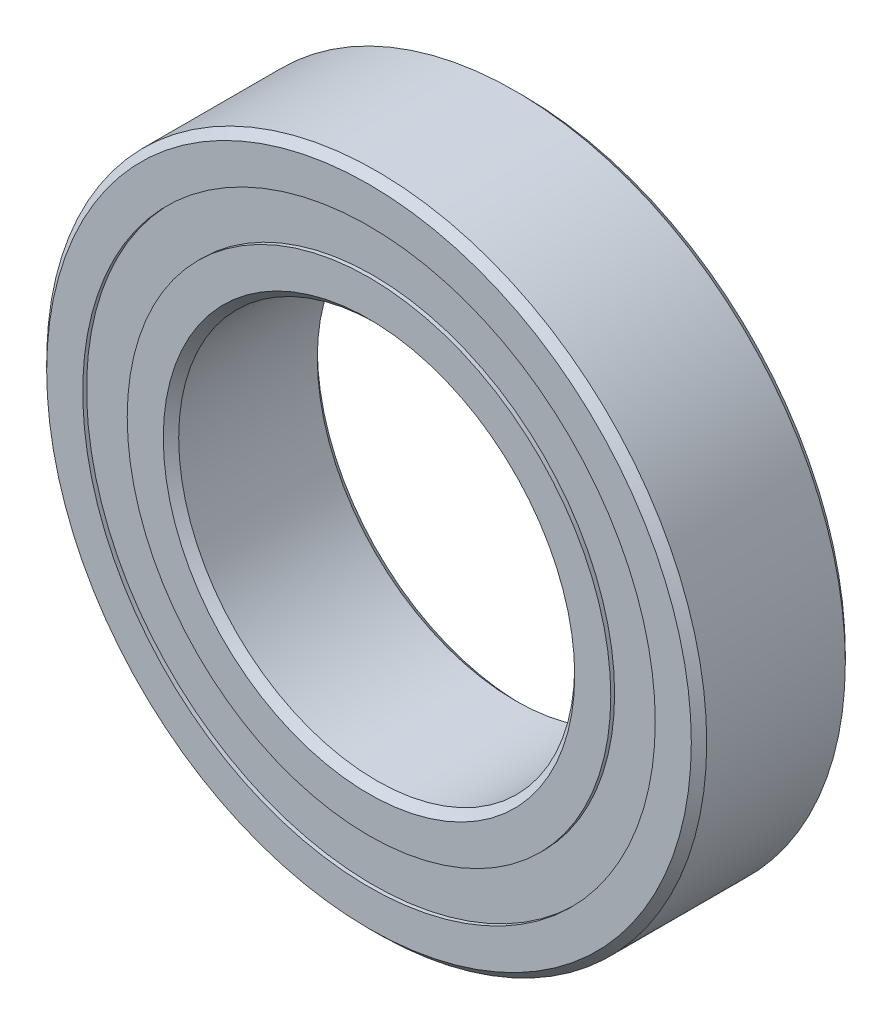
ISO-10303-21;
HEADER;
FILE_DESCRIPTION(('STEP AP214'),'2;1');
FILE_NAME('part.step','',(''),(''),'','','');
FILE_SCHEMA(('AUTOMOTIVE_DESIGN { 1 0 10303 214 1 1 1 1 }'));
ENDSEC;
DATA;
#1=APPLICATION_CONTEXT('core data for automotive mechanical design processes');
#2=APPLICATION_PROTOCOL_DEFINITION('international standard','automotive_design',2000,#1);
#3=PRODUCT_CONTEXT('',#1,'mechanical');
#4=PRODUCT('Part','Part','',(#3));
#5=PRODUCT_RELATED_PRODUCT_CATEGORY('part','',(#4));
#6=PRODUCT_DEFINITION_FORMATION('','',#4);
#7=PRODUCT_DEFINITION_CONTEXT('part definition',#1,'design');
#8=PRODUCT_DEFINITION('design','',#6,#7);
#9=PRODUCT_DEFINITION_SHAPE('','',#8);
#10=(LENGTH_UNIT() NAMED_UNIT(*) SI_UNIT(.MILLI.,.METRE.));
#11=(NAMED_UNIT(*) PLANE_ANGLE_UNIT() SI_UNIT($,.RADIAN.));
#12=(NAMED_UNIT(*) SI_UNIT($,.STERADIAN.) SOLID_ANGLE_UNIT());
#13=UNCERTAINTY_MEASURE_WITH_UNIT(LENGTH_MEASURE(1.E-05),#10,'distance_accuracy_value','');
#14=(GEOMETRIC_REPRESENTATION_CONTEXT(3) GLOBAL_UNCERTAINTY_ASSIGNED_CONTEXT((#13)) GLOBAL_UNIT_ASSIGNED_CONTEXT((#10,
#11,#12)) REPRESENTATION_CONTEXT('',''));
#15=CARTESIAN_POINT('',(0.,0.,0.));
#16=DIRECTION('',(0.,0.,1.));
#17=DIRECTION('',(1.,0.,0.));
#18=AXIS2_PLACEMENT_3D('',#15,#16,#17);
#19=CARTESIAN_POINT('',(0.,13.010989010989,-3.325));
#20=DIRECTION('',(0.,0.,1.));
#21=DIRECTION('',(1.,0.,0.));
#22=AXIS2_PLACEMENT_3D('',#19,#20,#21);
#23=PLANE('',#22);
#24=CARTESIAN_POINT('',(0.,0.,-3.325));
#25=DIRECTION('',(0.,0.,1.));
#26=DIRECTION('',(1.,0.,0.));
#27=AXIS2_PLACEMENT_3D('',#24,#25,#26);
#28=CIRCLE('',#27,13.010989010989);
#29=CARTESIAN_POINT('',(13.010989010989,0.,-3.325));
#30=VERTEX_POINT('',#29);
#31=EDGE_CURVE('E62',#30,#30,#28,.T.);
#32=ORIENTED_EDGE('',*,*,#31,.F.);
#33=EDGE_LOOP('',(#32));
#34=FACE_BOUND('',#33,.T.);
#35=CARTESIAN_POINT('',(0.,0.,-3.325));
#36=DIRECTION('',(0.,0.,1.));
#37=DIRECTION('',(1.,0.,0.));
#38=AXIS2_PLACEMENT_3D('',#35,#36,#37);
#39=CIRCLE('',#38,10.989010989011);
#40=CARTESIAN_POINT('',(10.989010989011,0.,-3.325));
#41=VERTEX_POINT('',#40);
#42=EDGE_CURVE('E11',#41,#41,#39,.T.);
#43=ORIENTED_EDGE('',*,*,#42,.T.);
#44=EDGE_LOOP('',(#43));
#45=FACE_BOUND('',#44,.T.);
#46=ADVANCED_FACE('F48',(#34,#45),#23,.F.);
#47=CARTESIAN_POINT('',(0.,0.,3.5));
#48=DIRECTION('',(0.,0.,1.));
#49=DIRECTION('',(1.,0.,0.));
#50=AXIS2_PLACEMENT_3D('',#47,#48,#49);
#51=CYLINDRICAL_SURFACE('',#50,10.989010989011);
#52=ORIENTED_EDGE('',*,*,#42,.F.);
#53=EDGE_LOOP('',(#52));
#54=FACE_BOUND('',#53,.T.);
#55=CARTESIAN_POINT('',(0.,0.,-1.85522286175012));
#56=DIRECTION('',(0.,0.,1.));
#57=DIRECTION('',(1.,0.,0.));
#58=AXIS2_PLACEMENT_3D('',#55,#56,#57);
#59=CIRCLE('',#58,10.989010989011);
#60=CARTESIAN_POINT('',(10.989010989011,0.,-1.85522286175012));
#61=VERTEX_POINT('',#60);
#62=EDGE_CURVE('E54',#61,#61,#59,.T.);
#63=ORIENTED_EDGE('',*,*,#62,.T.);
#64=EDGE_LOOP('',(#63));
#65=FACE_BOUND('',#64,.T.);
#66=ADVANCED_FACE('F71',(#54,#65),#51,.F.);
#67=CARTESIAN_POINT('',(0.,13.010989010989,-1.85522286175012));
#68=DIRECTION('',(0.,0.,-1.));
#69=DIRECTION('',(-1.,0.,0.));
#70=AXIS2_PLACEMENT_3D('',#67,#68,#69);
#71=PLANE('',#70);
#72=ORIENTED_EDGE('',*,*,#62,.F.);
#73=EDGE_LOOP('',(#72));
#74=FACE_BOUND('',#73,.T.);
#75=CARTESIAN_POINT('',(0.,0.,-1.85522286175012));
#76=DIRECTION('',(0.,0.,1.));
#77=DIRECTION('',(1.,0.,0.));
#78=AXIS2_PLACEMENT_3D('',#75,#76,#77);
#79=CIRCLE('',#78,13.010989010989);
#80=CARTESIAN_POINT('',(13.010989010989,0.,-1.85522286175012));
#81=VERTEX_POINT('',#80);
#82=EDGE_CURVE('E58',#81,#81,#79,.T.);
#83=ORIENTED_EDGE('',*,*,#82,.T.);
#84=EDGE_LOOP('',(#83));
#85=FACE_BOUND('',#84,.T.);
#86=ADVANCED_FACE('F75',(#74,#85),#71,.F.);
#87=CARTESIAN_POINT('',(0.,0.,3.5));
#88=DIRECTION('',(0.,0.,1.));
#89=DIRECTION('',(1.,0.,0.));
#90=AXIS2_PLACEMENT_3D('',#87,#88,#89);
#91=CYLINDRICAL_SURFACE('',#90,13.010989010989);
#92=ORIENTED_EDGE('',*,*,#82,.F.);
#93=EDGE_LOOP('',(#92));
#94=FACE_BOUND('',#93,.T.);
#95=ORIENTED_EDGE('',*,*,#31,.T.);
#96=EDGE_LOOP('',(#95));
#97=FACE_BOUND('',#96,.T.);
#98=ADVANCED_FACE('F68',(#94,#97),#91,.T.);
#99=CLOSED_SHELL('',(#46,#66,#86,#98));
#100=MANIFOLD_SOLID_BREP('B2',#99);
#101=CARTESIAN_POINT('',(0.,13.010989010989,3.325));
#102=DIRECTION('',(0.,0.,-1.));
#103=DIRECTION('',(-1.,0.,0.));
#104=AXIS2_PLACEMENT_3D('',#101,#102,#103);
#105=PLANE('',#104);
#106=CARTESIAN_POINT('',(0.,0.,3.325));
#107=DIRECTION('',(0.,0.,1.));
#108=DIRECTION('',(1.,0.,0.));
#109=AXIS2_PLACEMENT_3D('',#106,#107,#108);
#110=CIRCLE('',#109,10.989010989011);
#111=CARTESIAN_POINT('',(10.989010989011,0.,3.325));
#112=VERTEX_POINT('',#111);
#113=EDGE_CURVE('E47',#112,#112,#110,.T.);
#114=ORIENTED_EDGE('',*,*,#113,.F.);
#115=EDGE_LOOP('',(#114));
#116=FACE_BOUND('',#115,.T.);
#117=CARTESIAN_POINT('',(0.,0.,3.325));
#118=DIRECTION('',(0.,0.,1.));
#119=DIRECTION('',(1.,0.,0.));
#120=AXIS2_PLACEMENT_3D('',#117,#118,#119);
#121=CIRCLE('',#120,13.010989010989);
#122=CARTESIAN_POINT('',(13.010989010989,0.,3.325));
#123=VERTEX_POINT('',#122);
#124=EDGE_CURVE('E130',#123,#123,#121,.T.);
#125=ORIENTED_EDGE('',*,*,#124,.T.);
#126=EDGE_LOOP('',(#125));
#127=FACE_BOUND('',#126,.T.);
#128=ADVANCED_FACE('F116',(#116,#127),#105,.F.);
#129=CARTESIAN_POINT('',(0.,0.,3.5));
#130=DIRECTION('',(0.,0.,1.));
#131=DIRECTION('',(1.,0.,0.));
#132=AXIS2_PLACEMENT_3D('',#129,#130,#131);
#133=CYLINDRICAL_SURFACE('',#132,10.989010989011);
#134=CARTESIAN_POINT('',(0.,0.,1.85522286175011));
#135=DIRECTION('',(0.,0.,1.));
#136=DIRECTION('',(1.,0.,0.));
#137=AXIS2_PLACEMENT_3D('',#134,#135,#136);
#138=CIRCLE('',#137,10.989010989011);
#139=CARTESIAN_POINT('',(10.989010989011,0.,1.85522286175011));
#140=VERTEX_POINT('',#139);
#141=EDGE_CURVE('E122',#140,#140,#138,.T.);
#142=ORIENTED_EDGE('',*,*,#141,.F.);
#143=EDGE_LOOP('',(#142));
#144=FACE_BOUND('',#143,.T.);
#145=ORIENTED_EDGE('',*,*,#113,.T.);
#146=EDGE_LOOP('',(#145));
#147=FACE_BOUND('',#146,.T.);
#148=ADVANCED_FACE('F145',(#144,#147),#133,.F.);
#149=CARTESIAN_POINT('',(0.,13.010989010989,1.85522286175011));
#150=DIRECTION('',(0.,0.,1.));
#151=DIRECTION('',(1.,0.,0.));
#152=AXIS2_PLACEMENT_3D('',#149,#150,#151);
#153=PLANE('',#152);
#154=CARTESIAN_POINT('',(0.,0.,1.85522286175011));
#155=DIRECTION('',(0.,0.,1.));
#156=DIRECTION('',(1.,0.,0.));
#157=AXIS2_PLACEMENT_3D('',#154,#155,#156);
#158=CIRCLE('',#157,13.010989010989);
#159=CARTESIAN_POINT('',(13.010989010989,0.,1.85522286175011));
#160=VERTEX_POINT('',#159);
#161=EDGE_CURVE('E126',#160,#160,#158,.T.);
#162=ORIENTED_EDGE('',*,*,#161,.F.);
#163=EDGE_LOOP('',(#162));
#164=FACE_BOUND('',#163,.T.);
#165=ORIENTED_EDGE('',*,*,#141,.T.);
#166=EDGE_LOOP('',(#165));
#167=FACE_BOUND('',#166,.T.);
#168=ADVANCED_FACE('F140',(#164,#167),#153,.F.);
#169=CARTESIAN_POINT('',(0.,0.,3.5));
#170=DIRECTION('',(0.,0.,1.));
#171=DIRECTION('',(1.,0.,0.));
#172=AXIS2_PLACEMENT_3D('',#169,#170,#171);
#173=CYLINDRICAL_SURFACE('',#172,13.010989010989);
#174=ORIENTED_EDGE('',*,*,#124,.F.);
#175=EDGE_LOOP('',(#174));
#176=FACE_BOUND('',#175,.T.);
#177=ORIENTED_EDGE('',*,*,#161,.T.);
#178=EDGE_LOOP('',(#177));
#179=FACE_BOUND('',#178,.T.);
#180=ADVANCED_FACE('F137',(#176,#179),#173,.T.);
#181=CLOSED_SHELL('',(#128,#148,#168,#180));
#182=MANIFOLD_SOLID_BREP('B6',#181);
#183=CARTESIAN_POINT('',(-5.99999999999987,10.3923048454133,0.));
#184=DIRECTION('',(0.,0.,1.));
#185=DIRECTION('',(-0.499999999999989,0.866025403784445,0.));
#186=AXIS2_PLACEMENT_3D('',#183,#184,#185);
#187=SPHERICAL_SURFACE('',#186,1.85522286175011);
#188=CARTESIAN_POINT('',(-5.99999999999987,10.3923048454133,1.85522286175011));
#189=VERTEX_POINT('',#188);
#190=VERTEX_LOOP('',#189);
#191=FACE_BOUND('',#190,.T.);
#192=ADVANCED_FACE('F184',(#191),#187,.T.);
#193=CLOSED_SHELL('',(#192));
#194=MANIFOLD_SOLID_BREP('B42',#193);
#195=CARTESIAN_POINT('',(-10.3923048454132,6.00000000000012,0.));
#196=DIRECTION('',(0.,0.,1.));
#197=DIRECTION('',(-0.866025403784433,0.50000000000001,0.));
#198=AXIS2_PLACEMENT_3D('',#195,#196,#197);
#199=SPHERICAL_SURFACE('',#198,1.85522286175011);
#200=CARTESIAN_POINT('',(-10.3923048454132,6.00000000000012,1.85522286175011));
#201=VERTEX_POINT('',#200);
#202=VERTEX_LOOP('',#201);
#203=FACE_BOUND('',#202,.T.);
#204=ADVANCED_FACE('F205',(#203),#199,.T.);
#205=CLOSED_SHELL('',(#204));
#206=MANIFOLD_SOLID_BREP('B112',#205);
#207=CARTESIAN_POINT('',(-12.,1.25693328198353E-13,0.));
#208=DIRECTION('',(0.,0.,1.));
#209=DIRECTION('',(-1.,0.,0.));
#210=AXIS2_PLACEMENT_3D('',#207,#208,#209);
#211=SPHERICAL_SURFACE('',#210,1.85522286175011);
#212=CARTESIAN_POINT('',(-12.,1.25693328198353E-13,1.85522286175011));
#213=VERTEX_POINT('',#212);
#214=VERTEX_LOOP('',#213);
#215=FACE_BOUND('',#214,.T.);
#216=ADVANCED_FACE('F226',(#215),#211,.T.);
#217=CLOSED_SHELL('',(#216));
#218=MANIFOLD_SOLID_BREP('B180',#217);
#219=CARTESIAN_POINT('',(-10.3923048454133,-5.9999999999999,0.));
#220=DIRECTION('',(0.,0.,1.));
#221=DIRECTION('',(-0.866025403784443,-0.499999999999992,0.));
#222=AXIS2_PLACEMENT_3D('',#219,#220,#221);
#223=SPHERICAL_SURFACE('',#222,1.85522286175011);
#224=CARTESIAN_POINT('',(-10.3923048454133,-5.9999999999999,1.85522286175011));
#225=VERTEX_POINT('',#224);
#226=VERTEX_LOOP('',#225);
#227=FACE_BOUND('',#226,.T.);
#228=ADVANCED_FACE('F247',(#227),#223,.T.);
#229=CLOSED_SHELL('',(#228));
#230=MANIFOLD_SOLID_BREP('B201',#229);
#231=CARTESIAN_POINT('',(-6.00000000000009,-10.3923048454132,0.));
#232=DIRECTION('',(0.,0.,1.));
#233=DIRECTION('',(-0.500000000000007,-0.866025403784435,0.));
#234=AXIS2_PLACEMENT_3D('',#231,#232,#233);
#235=SPHERICAL_SURFACE('',#234,1.85522286175011);
#236=CARTESIAN_POINT('',(-6.00000000000009,-10.3923048454132,1.85522286175011));
#237=VERTEX_POINT('',#236);
#238=VERTEX_LOOP('',#237);
#239=FACE_BOUND('',#238,.T.);
#240=ADVANCED_FACE('F268',(#239),#235,.T.);
#241=CLOSED_SHELL('',(#240));
#242=MANIFOLD_SOLID_BREP('B222',#241);
#243=CARTESIAN_POINT('',(0.,-12.,0.));
#244=DIRECTION('',(0.,0.,1.));
#245=DIRECTION('',(0.,-1.,0.));
#246=AXIS2_PLACEMENT_3D('',#243,#244,#245);
#247=SPHERICAL_SURFACE('',#246,1.85522286175011);
#248=CARTESIAN_POINT('',(0.,-12.,1.85522286175011));
#249=VERTEX_POINT('',#248);
#250=VERTEX_LOOP('',#249);
#251=FACE_BOUND('',#250,.T.);
#252=ADVANCED_FACE('F289',(#251),#247,.T.);
#253=CLOSED_SHELL('',(#252));
#254=MANIFOLD_SOLID_BREP('B243',#253);
#255=CARTESIAN_POINT('',(5.99999999999994,-10.3923048454133,0.));
#256=DIRECTION('',(0.,0.,1.));
#257=DIRECTION('',(0.499999999999995,-0.866025403784442,0.));
#258=AXIS2_PLACEMENT_3D('',#255,#256,#257);
#259=SPHERICAL_SURFACE('',#258,1.85522286175011);
#260=CARTESIAN_POINT('',(5.99999999999994,-10.3923048454133,1.85522286175011));
#261=VERTEX_POINT('',#260);
#262=VERTEX_LOOP('',#261);
#263=FACE_BOUND('',#262,.T.);
#264=ADVANCED_FACE('F310',(#263),#259,.T.);
#265=CLOSED_SHELL('',(#264));
#266=MANIFOLD_SOLID_BREP('B264',#265);
#267=CARTESIAN_POINT('',(10.3923048454132,-6.00000000000005,0.));
#268=DIRECTION('',(0.,0.,1.));
#269=DIRECTION('',(0.866025403784436,-0.500000000000004,0.));
#270=AXIS2_PLACEMENT_3D('',#267,#268,#269);
#271=SPHERICAL_SURFACE('',#270,1.85522286175011);
#272=CARTESIAN_POINT('',(10.3923048454132,-6.00000000000005,1.85522286175011));
#273=VERTEX_POINT('',#272);
#274=VERTEX_LOOP('',#273);
#275=FACE_BOUND('',#274,.T.);
#276=ADVANCED_FACE('F331',(#275),#271,.T.);
#277=CLOSED_SHELL('',(#276));
#278=MANIFOLD_SOLID_BREP('B285',#277);
#279=CARTESIAN_POINT('',(12.,0.,0.));
#280=DIRECTION('',(0.,0.,1.));
#281=DIRECTION('',(1.,0.,0.));
#282=AXIS2_PLACEMENT_3D('',#279,#280,#281);
#283=SPHERICAL_SURFACE('',#282,1.85522286175011);
#284=CARTESIAN_POINT('',(12.,0.,1.85522286175011));
#285=VERTEX_POINT('',#284);
#286=VERTEX_LOOP('',#285);
#287=FACE_BOUND('',#286,.T.);
#288=ADVANCED_FACE('F352',(#287),#283,.T.);
#289=CLOSED_SHELL('',(#288));
#290=MANIFOLD_SOLID_BREP('B306',#289);
#291=CARTESIAN_POINT('',(10.3923048454133,5.99999999999998,0.));
#292=DIRECTION('',(0.,0.,1.));
#293=DIRECTION('',(0.86602540378444,0.499999999999998,0.));
#294=AXIS2_PLACEMENT_3D('',#291,#292,#293);
#295=SPHERICAL_SURFACE('',#294,1.85522286175011);
#296=CARTESIAN_POINT('',(10.3923048454133,5.99999999999998,1.85522286175011));
#297=VERTEX_POINT('',#296);
#298=VERTEX_LOOP('',#297);
#299=FACE_BOUND('',#298,.T.);
#300=ADVANCED_FACE('F373',(#299),#295,.T.);
#301=CLOSED_SHELL('',(#300));
#302=MANIFOLD_SOLID_BREP('B327',#301);
#303=CARTESIAN_POINT('',(6.00000000000001,10.3923048454133,0.));
#304=DIRECTION('',(0.,0.,1.));
#305=DIRECTION('',(0.500000000000001,0.866025403784438,0.));
#306=AXIS2_PLACEMENT_3D('',#303,#304,#305);
#307=SPHERICAL_SURFACE('',#306,1.85522286175011);
#308=CARTESIAN_POINT('',(6.00000000000001,10.3923048454133,1.85522286175011));
#309=VERTEX_POINT('',#308);
#310=VERTEX_LOOP('',#309);
#311=FACE_BOUND('',#310,.T.);
#312=ADVANCED_FACE('F394',(#311),#307,.T.);
#313=CLOSED_SHELL('',(#312));
#314=MANIFOLD_SOLID_BREP('B348',#313);
#315=CARTESIAN_POINT('',(0.,12.,0.));
#316=DIRECTION('',(0.,0.,1.));
#317=DIRECTION('',(0.,1.,0.));
#318=AXIS2_PLACEMENT_3D('',#315,#316,#317);
#319=SPHERICAL_SURFACE('',#318,1.85522286175011);
#320=CARTESIAN_POINT('',(0.,12.,1.85522286175011));
#321=VERTEX_POINT('',#320);
#322=VERTEX_LOOP('',#321);
#323=FACE_BOUND('',#322,.T.);
#324=ADVANCED_FACE('F417',(#323),#319,.T.);
#325=CLOSED_SHELL('',(#324));
#326=MANIFOLD_SOLID_BREP('B369',#325);
#327=CARTESIAN_POINT('',(0.,10.989010989011,3.5));
#328=DIRECTION('',(0.,0.,-1.));
#329=DIRECTION('',(-1.,0.,0.));
#330=AXIS2_PLACEMENT_3D('',#327,#328,#329);
#331=PLANE('',#330);
#332=CARTESIAN_POINT('',(0.,0.,3.5));
#333=DIRECTION('',(0.,0.,1.));
#334=DIRECTION('',(1.,0.,0.));
#335=AXIS2_PLACEMENT_3D('',#332,#333,#334);
#336=CIRCLE('',#335,9.35);
#337=CARTESIAN_POINT('',(9.35,0.,3.5));
#338=VERTEX_POINT('',#337);
#339=EDGE_CURVE('E465',#338,#338,#336,.T.);
#340=ORIENTED_EDGE('',*,*,#339,.F.);
#341=EDGE_LOOP('',(#340));
#342=FACE_BOUND('',#341,.T.);
#343=CARTESIAN_POINT('',(0.,0.,3.5));
#344=DIRECTION('',(0.,0.,1.));
#345=DIRECTION('',(1.,0.,0.));
#346=AXIS2_PLACEMENT_3D('',#343,#344,#345);
#347=CIRCLE('',#346,10.989010989011);
#348=CARTESIAN_POINT('',(10.989010989011,0.,3.5));
#349=VERTEX_POINT('',#348);
#350=EDGE_CURVE('E416',#349,#349,#347,.T.);
#351=ORIENTED_EDGE('',*,*,#350,.T.);
#352=EDGE_LOOP('',(#351));
#353=FACE_BOUND('',#352,.T.);
#354=ADVANCED_FACE('F437',(#342,#353),#331,.F.);
#355=CARTESIAN_POINT('',(0.,0.,3.5));
#356=DIRECTION('',(0.,0.,1.));
#357=DIRECTION('',(1.,0.,0.));
#358=AXIS2_PLACEMENT_3D('',#355,#356,#357);
#359=CYLINDRICAL_SURFACE('',#358,10.989010989011);
#360=ORIENTED_EDGE('',*,*,#350,.F.);
#361=EDGE_LOOP('',(#360));
#362=FACE_BOUND('',#361,.T.);
#363=CARTESIAN_POINT('',(0.,0.,1.55555555555556));
#364=DIRECTION('',(0.,0.,1.));
#365=DIRECTION('',(1.,0.,0.));
#366=AXIS2_PLACEMENT_3D('',#363,#364,#365);
#367=CIRCLE('',#366,10.989010989011);
#368=CARTESIAN_POINT('',(10.989010989011,0.,1.55555555555556));
#369=VERTEX_POINT('',#368);
#370=EDGE_CURVE('E443',#369,#369,#367,.T.);
#371=ORIENTED_EDGE('',*,*,#370,.T.);
#372=EDGE_LOOP('',(#371));
#373=FACE_BOUND('',#372,.T.);
#374=ADVANCED_FACE('F472',(#362,#373),#359,.T.);
#375=CARTESIAN_POINT('',(0.,0.,0.));
#376=DIRECTION('',(0.,0.,1.));
#377=DIRECTION('',(1.,0.,0.));
#378=AXIS2_PLACEMENT_3D('',#375,#376,#377);
#379=TOROIDAL_SURFACE('',#378,12.,1.85522286175011);
#380=ORIENTED_EDGE('',*,*,#370,.F.);
#381=EDGE_LOOP('',(#380));
#382=FACE_BOUND('',#381,.T.);
#383=CARTESIAN_POINT('',(0.,0.,-1.55555555555556));
#384=DIRECTION('',(0.,0.,1.));
#385=DIRECTION('',(1.,0.,0.));
#386=AXIS2_PLACEMENT_3D('',#383,#384,#385);
#387=CIRCLE('',#386,10.989010989011);
#388=CARTESIAN_POINT('',(10.989010989011,0.,-1.55555555555556));
#389=VERTEX_POINT('',#388);
#390=EDGE_CURVE('E447',#389,#389,#387,.T.);
#391=ORIENTED_EDGE('',*,*,#390,.T.);
#392=EDGE_LOOP('',(#391));
#393=FACE_BOUND('',#392,.T.);
#394=ADVANCED_FACE('F476',(#382,#393),#379,.F.);
#395=CARTESIAN_POINT('',(0.,0.,3.5));
#396=DIRECTION('',(0.,0.,1.));
#397=DIRECTION('',(1.,0.,0.));
#398=AXIS2_PLACEMENT_3D('',#395,#396,#397);
#399=CYLINDRICAL_SURFACE('',#398,10.989010989011);
#400=ORIENTED_EDGE('',*,*,#390,.F.);
#401=EDGE_LOOP('',(#400));
#402=FACE_BOUND('',#401,.T.);
#403=CARTESIAN_POINT('',(0.,0.,-3.5));
#404=DIRECTION('',(0.,0.,1.));
#405=DIRECTION('',(1.,0.,0.));
#406=AXIS2_PLACEMENT_3D('',#403,#404,#405);
#407=CIRCLE('',#406,10.989010989011);
#408=CARTESIAN_POINT('',(10.989010989011,0.,-3.5));
#409=VERTEX_POINT('',#408);
#410=EDGE_CURVE('E451',#409,#409,#407,.T.);
#411=ORIENTED_EDGE('',*,*,#410,.T.);
#412=EDGE_LOOP('',(#411));
#413=FACE_BOUND('',#412,.T.);
#414=ADVANCED_FACE('F481',(#402,#413),#399,.T.);
#415=CARTESIAN_POINT('',(0.,9.35,-3.5));
#416=DIRECTION('',(0.,0.,1.));
#417=DIRECTION('',(1.,0.,0.));
#418=AXIS2_PLACEMENT_3D('',#415,#416,#417);
#419=PLANE('',#418);
#420=ORIENTED_EDGE('',*,*,#410,.F.);
#421=EDGE_LOOP('',(#420));
#422=FACE_BOUND('',#421,.T.);
#423=CARTESIAN_POINT('',(0.,0.,-3.5));
#424=DIRECTION('',(0.,0.,1.));
#425=DIRECTION('',(1.,0.,0.));
#426=AXIS2_PLACEMENT_3D('',#423,#424,#425);
#427=CIRCLE('',#426,9.35);
#428=CARTESIAN_POINT('',(9.35,0.,-3.5));
#429=VERTEX_POINT('',#428);
#430=EDGE_CURVE('E456',#429,#429,#427,.T.);
#431=ORIENTED_EDGE('',*,*,#430,.T.);
#432=EDGE_LOOP('',(#431));
#433=FACE_BOUND('',#432,.T.);
#434=ADVANCED_FACE('F487',(#422,#433),#419,.F.);
#435=CARTESIAN_POINT('',(0.,0.,-3.15));
#436=DIRECTION('',(0.,0.,-1.));
#437=DIRECTION('',(-1.,0.,0.));
#438=AXIS2_PLACEMENT_3D('',#435,#436,#437);
#439=CONICAL_SURFACE('',#438,9.,0.785398163397438);
#440=ORIENTED_EDGE('',*,*,#430,.F.);
#441=EDGE_LOOP('',(#440));
#442=FACE_BOUND('',#441,.T.);
#443=CARTESIAN_POINT('',(0.,0.,-3.15));
#444=DIRECTION('',(0.,0.,1.));
#445=DIRECTION('',(1.,0.,0.));
#446=AXIS2_PLACEMENT_3D('',#443,#444,#445);
#447=CIRCLE('',#446,9.);
#448=CARTESIAN_POINT('',(9.,0.,-3.15));
#449=VERTEX_POINT('',#448);
#450=EDGE_CURVE('E459',#449,#449,#447,.T.);
#451=ORIENTED_EDGE('',*,*,#450,.T.);
#452=EDGE_LOOP('',(#451));
#453=FACE_BOUND('',#452,.T.);
#454=ADVANCED_FACE('F491',(#442,#453),#439,.F.);
#455=CARTESIAN_POINT('',(0.,0.,3.5));
#456=DIRECTION('',(0.,0.,1.));
#457=DIRECTION('',(1.,0.,0.));
#458=AXIS2_PLACEMENT_3D('',#455,#456,#457);
#459=CYLINDRICAL_SURFACE('',#458,9.);
#460=ORIENTED_EDGE('',*,*,#450,.F.);
#461=EDGE_LOOP('',(#460));
#462=FACE_BOUND('',#461,.T.);
#463=CARTESIAN_POINT('',(0.,0.,3.15));
#464=DIRECTION('',(0.,0.,1.));
#465=DIRECTION('',(1.,0.,0.));
#466=AXIS2_PLACEMENT_3D('',#463,#464,#465);
#467=CIRCLE('',#466,9.);
#468=CARTESIAN_POINT('',(9.,0.,3.15));
#469=VERTEX_POINT('',#468);
#470=EDGE_CURVE('E462',#469,#469,#467,.T.);
#471=ORIENTED_EDGE('',*,*,#470,.T.);
#472=EDGE_LOOP('',(#471));
#473=FACE_BOUND('',#472,.T.);
#474=ADVANCED_FACE('F495',(#462,#473),#459,.F.);
#475=CARTESIAN_POINT('',(0.,0.,3.5));
#476=DIRECTION('',(0.,0.,1.));
#477=DIRECTION('',(1.,0.,0.));
#478=AXIS2_PLACEMENT_3D('',#475,#476,#477);
#479=CONICAL_SURFACE('',#478,9.35,0.785398163397457);
#480=ORIENTED_EDGE('',*,*,#470,.F.);
#481=EDGE_LOOP('',(#480));
#482=FACE_BOUND('',#481,.T.);
#483=ORIENTED_EDGE('',*,*,#339,.T.);
#484=EDGE_LOOP('',(#483));
#485=FACE_BOUND('',#484,.T.);
#486=ADVANCED_FACE('F469',(#482,#485),#479,.F.);
#487=CLOSED_SHELL('',(#354,#374,#394,#414,#434,#454,#474,#486));
#488=MANIFOLD_SOLID_BREP('B390',#487);
#489=CARTESIAN_POINT('',(0.,0.,3.15));
#490=DIRECTION('',(0.,0.,-1.));
#491=DIRECTION('',(-1.,0.,0.));
#492=AXIS2_PLACEMENT_3D('',#489,#490,#491);
#493=CONICAL_SURFACE('',#492,15.,0.785398163397443);
#494=CARTESIAN_POINT('',(0.,0.,3.5));
#495=DIRECTION('',(0.,0.,1.));
#496=DIRECTION('',(1.,0.,0.));
#497=AXIS2_PLACEMENT_3D('',#494,#495,#496);
#498=CIRCLE('',#497,14.65);
#499=CARTESIAN_POINT('',(14.65,0.,3.5));
#500=VERTEX_POINT('',#499);
#501=EDGE_CURVE('E594',#500,#500,#498,.T.);
#502=ORIENTED_EDGE('',*,*,#501,.F.);
#503=EDGE_LOOP('',(#502));
#504=FACE_BOUND('',#503,.T.);
#505=CARTESIAN_POINT('',(0.,0.,3.15));
#506=DIRECTION('',(0.,0.,1.));
#507=DIRECTION('',(1.,0.,0.));
#508=AXIS2_PLACEMENT_3D('',#505,#506,#507);
#509=CIRCLE('',#508,15.);
#510=CARTESIAN_POINT('',(15.,0.,3.15));
#511=VERTEX_POINT('',#510);
#512=EDGE_CURVE('E436',#511,#511,#509,.T.);
#513=ORIENTED_EDGE('',*,*,#512,.T.);
#514=EDGE_LOOP('',(#513));
#515=FACE_BOUND('',#514,.T.);
#516=ADVANCED_FACE('F559',(#504,#515),#493,.T.);
#517=CARTESIAN_POINT('',(0.,0.,3.5));
#518=DIRECTION('',(0.,0.,1.));
#519=DIRECTION('',(1.,0.,0.));
#520=AXIS2_PLACEMENT_3D('',#517,#518,#519);
#521=CYLINDRICAL_SURFACE('',#520,15.);
#522=ORIENTED_EDGE('',*,*,#512,.F.);
#523=EDGE_LOOP('',(#522));
#524=FACE_BOUND('',#523,.T.);
#525=CARTESIAN_POINT('',(0.,0.,-3.15));
#526=DIRECTION('',(0.,0.,1.));
#527=DIRECTION('',(1.,0.,0.));
#528=AXIS2_PLACEMENT_3D('',#525,#526,#527);
#529=CIRCLE('',#528,15.);
#530=CARTESIAN_POINT('',(15.,0.,-3.15));
#531=VERTEX_POINT('',#530);
#532=EDGE_CURVE('E566',#531,#531,#529,.T.);
#533=ORIENTED_EDGE('',*,*,#532,.T.);
#534=EDGE_LOOP('',(#533));
#535=FACE_BOUND('',#534,.T.);
#536=ADVANCED_FACE('F602',(#524,#535),#521,.T.);
#537=CARTESIAN_POINT('',(0.,0.,-3.5));
#538=DIRECTION('',(0.,0.,1.));
#539=DIRECTION('',(1.,0.,0.));
#540=AXIS2_PLACEMENT_3D('',#537,#538,#539);
#541=CONICAL_SURFACE('',#540,14.65,0.785398163397442);
#542=ORIENTED_EDGE('',*,*,#532,.F.);
#543=EDGE_LOOP('',(#542));
#544=FACE_BOUND('',#543,.T.);
#545=CARTESIAN_POINT('',(0.,0.,-3.5));
#546=DIRECTION('',(0.,0.,1.));
#547=DIRECTION('',(1.,0.,0.));
#548=AXIS2_PLACEMENT_3D('',#545,#546,#547);
#549=CIRCLE('',#548,14.65);
#550=CARTESIAN_POINT('',(14.65,0.,-3.5));
#551=VERTEX_POINT('',#550);
#552=EDGE_CURVE('E571',#551,#551,#549,.T.);
#553=ORIENTED_EDGE('',*,*,#552,.T.);
#554=EDGE_LOOP('',(#553));
#555=FACE_BOUND('',#554,.T.);
#556=ADVANCED_FACE('F606',(#544,#555),#541,.T.);
#557=CARTESIAN_POINT('',(0.,14.65,-3.5));
#558=DIRECTION('',(0.,0.,1.));
#559=DIRECTION('',(1.,0.,0.));
#560=AXIS2_PLACEMENT_3D('',#557,#558,#559);
#561=PLANE('',#560);
#562=ORIENTED_EDGE('',*,*,#552,.F.);
#563=EDGE_LOOP('',(#562));
#564=FACE_BOUND('',#563,.T.);
#565=CARTESIAN_POINT('',(0.,0.,-3.5));
#566=DIRECTION('',(0.,0.,1.));
#567=DIRECTION('',(1.,0.,0.));
#568=AXIS2_PLACEMENT_3D('',#565,#566,#567);
#569=CIRCLE('',#568,13.010989010989);
#570=CARTESIAN_POINT('',(13.010989010989,0.,-3.5));
#571=VERTEX_POINT('',#570);
#572=EDGE_CURVE('E576',#571,#571,#569,.T.);
#573=ORIENTED_EDGE('',*,*,#572,.T.);
#574=EDGE_LOOP('',(#573));
#575=FACE_BOUND('',#574,.T.);
#576=ADVANCED_FACE('F611',(#564,#575),#561,.F.);
#577=CARTESIAN_POINT('',(0.,0.,3.5));
#578=DIRECTION('',(0.,0.,1.));
#579=DIRECTION('',(1.,0.,0.));
#580=AXIS2_PLACEMENT_3D('',#577,#578,#579);
#581=CYLINDRICAL_SURFACE('',#580,13.010989010989);
#582=ORIENTED_EDGE('',*,*,#572,.F.);
#583=EDGE_LOOP('',(#582));
#584=FACE_BOUND('',#583,.T.);
#585=CARTESIAN_POINT('',(0.,0.,-1.55555555555556));
#586=DIRECTION('',(0.,0.,1.));
#587=DIRECTION('',(1.,0.,0.));
#588=AXIS2_PLACEMENT_3D('',#585,#586,#587);
#589=CIRCLE('',#588,13.010989010989);
#590=CARTESIAN_POINT('',(13.010989010989,0.,-1.55555555555556));
#591=VERTEX_POINT('',#590);
#592=EDGE_CURVE('E582',#591,#591,#589,.T.);
#593=ORIENTED_EDGE('',*,*,#592,.T.);
#594=EDGE_LOOP('',(#593));
#595=FACE_BOUND('',#594,.T.);
#596=ADVANCED_FACE('F617',(#584,#595),#581,.F.);
#597=CARTESIAN_POINT('',(0.,0.,0.));
#598=DIRECTION('',(0.,0.,1.));
#599=DIRECTION('',(1.,0.,0.));
#600=AXIS2_PLACEMENT_3D('',#597,#598,#599);
#601=TOROIDAL_SURFACE('',#600,12.,1.85522286175012);
#602=ORIENTED_EDGE('',*,*,#592,.F.);
#603=EDGE_LOOP('',(#602));
#604=FACE_BOUND('',#603,.T.);
#605=CARTESIAN_POINT('',(0.,0.,1.55555555555556));
#606=DIRECTION('',(0.,0.,1.));
#607=DIRECTION('',(1.,0.,0.));
#608=AXIS2_PLACEMENT_3D('',#605,#606,#607);
#609=CIRCLE('',#608,13.010989010989);
#610=CARTESIAN_POINT('',(13.010989010989,0.,1.55555555555556));
#611=VERTEX_POINT('',#610);
#612=EDGE_CURVE('E586',#611,#611,#609,.T.);
#613=ORIENTED_EDGE('',*,*,#612,.T.);
#614=EDGE_LOOP('',(#613));
#615=FACE_BOUND('',#614,.T.);
#616=ADVANCED_FACE('F621',(#604,#615),#601,.F.);
#617=CARTESIAN_POINT('',(0.,0.,3.5));
#618=DIRECTION('',(0.,0.,1.));
#619=DIRECTION('',(1.,0.,0.));
#620=AXIS2_PLACEMENT_3D('',#617,#618,#619);
#621=CYLINDRICAL_SURFACE('',#620,13.010989010989);
#622=ORIENTED_EDGE('',*,*,#612,.F.);
#623=EDGE_LOOP('',(#622));
#624=FACE_BOUND('',#623,.T.);
#625=CARTESIAN_POINT('',(0.,0.,3.5));
#626=DIRECTION('',(0.,0.,1.));
#627=DIRECTION('',(1.,0.,0.));
#628=AXIS2_PLACEMENT_3D('',#625,#626,#627);
#629=CIRCLE('',#628,13.010989010989);
#630=CARTESIAN_POINT('',(13.010989010989,0.,3.5));
#631=VERTEX_POINT('',#630);
#632=EDGE_CURVE('E590',#631,#631,#629,.T.);
#633=ORIENTED_EDGE('',*,*,#632,.T.);
#634=EDGE_LOOP('',(#633));
#635=FACE_BOUND('',#634,.T.);
#636=ADVANCED_FACE('F625',(#624,#635),#621,.F.);
#637=CARTESIAN_POINT('',(0.,14.65,3.5));
#638=DIRECTION('',(0.,0.,-1.));
#639=DIRECTION('',(-1.,0.,0.));
#640=AXIS2_PLACEMENT_3D('',#637,#638,#639);
#641=PLANE('',#640);
#642=ORIENTED_EDGE('',*,*,#632,.F.);
#643=EDGE_LOOP('',(#642));
#644=FACE_BOUND('',#643,.T.);
#645=ORIENTED_EDGE('',*,*,#501,.T.);
#646=EDGE_LOOP('',(#645));
#647=FACE_BOUND('',#646,.T.);
#648=ADVANCED_FACE('F599',(#644,#647),#641,.F.);
#649=CLOSED_SHELL('',(#516,#536,#556,#576,#596,#616,#636,#648));
#650=MANIFOLD_SOLID_BREP('B411',#649);
#651=ADVANCED_BREP_SHAPE_REPRESENTATION('',(#18,#100,#182,#194,#206,#218,#230,#242,#254,#266,
#278,#290,#302,#314,#326,#488,#650),#14);
#652=SHAPE_DEFINITION_REPRESENTATION(#9,#651);
ENDSEC;
END-ISO-10303-21;
